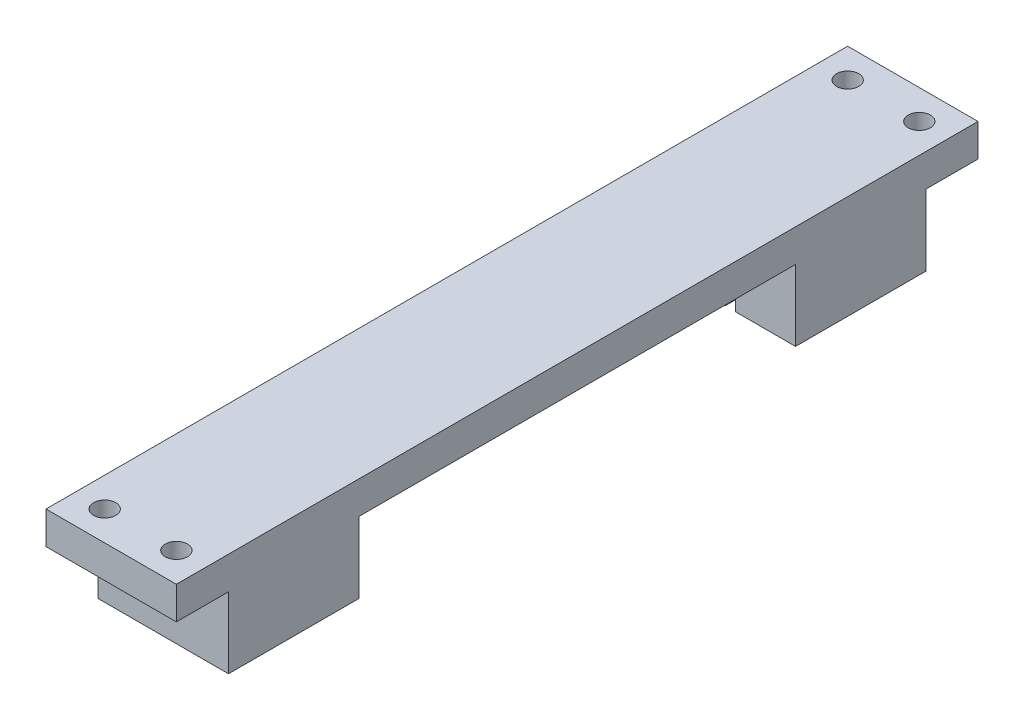
ISO-10303-21;
HEADER;
FILE_DESCRIPTION(('STEP AP214'),'2;1');
FILE_NAME('part.step','',(''),(''),'','','');
FILE_SCHEMA(('AUTOMOTIVE_DESIGN { 1 0 10303 214 1 1 1 1 }'));
ENDSEC;
DATA;
#1=APPLICATION_CONTEXT('core data for automotive mechanical design processes');
#2=APPLICATION_PROTOCOL_DEFINITION('international standard','automotive_design',2000,#1);
#3=PRODUCT_CONTEXT('',#1,'mechanical');
#4=PRODUCT('Part','Part','',(#3));
#5=PRODUCT_RELATED_PRODUCT_CATEGORY('part','',(#4));
#6=PRODUCT_DEFINITION_FORMATION('','',#4);
#7=PRODUCT_DEFINITION_CONTEXT('part definition',#1,'design');
#8=PRODUCT_DEFINITION('design','',#6,#7);
#9=PRODUCT_DEFINITION_SHAPE('','',#8);
#10=(LENGTH_UNIT() NAMED_UNIT(*) SI_UNIT(.MILLI.,.METRE.));
#11=(NAMED_UNIT(*) PLANE_ANGLE_UNIT() SI_UNIT($,.RADIAN.));
#12=(NAMED_UNIT(*) SI_UNIT($,.STERADIAN.) SOLID_ANGLE_UNIT());
#13=UNCERTAINTY_MEASURE_WITH_UNIT(LENGTH_MEASURE(1.E-05),#10,'distance_accuracy_value','');
#14=(GEOMETRIC_REPRESENTATION_CONTEXT(3) GLOBAL_UNCERTAINTY_ASSIGNED_CONTEXT((#13)) GLOBAL_UNIT_ASSIGNED_CONTEXT((#10,
#11,#12)) REPRESENTATION_CONTEXT('',''));
#15=CARTESIAN_POINT('',(0.,0.,0.));
#16=DIRECTION('',(0.,0.,1.));
#17=DIRECTION('',(1.,0.,0.));
#18=AXIS2_PLACEMENT_3D('',#15,#16,#17);
#19=CARTESIAN_POINT('',(10.,-10.9,-81.));
#20=DIRECTION('',(0.,0.,-1.));
#21=DIRECTION('',(-1.,0.,0.));
#22=AXIS2_PLACEMENT_3D('',#19,#20,#21);
#23=PLANE('',#22);
#24=DIRECTION('',(-1.,0.,0.));
#25=VECTOR('',#24,1.);
#26=CARTESIAN_POINT('',(10.,-10.9,-81.));
#27=LINE('',#26,#25);
#28=CARTESIAN_POINT('',(-0.799999999999998,-10.9,-81.));
#29=VERTEX_POINT('',#28);
#30=CARTESIAN_POINT('',(-10.,-10.9,-81.));
#31=VERTEX_POINT('',#30);
#32=EDGE_CURVE('E209',#29,#31,#27,.T.);
#33=ORIENTED_EDGE('',*,*,#32,.F.);
#34=DIRECTION('',(0.,1.,0.));
#35=VECTOR('',#34,1.);
#36=CARTESIAN_POINT('',(-0.799999999999999,-10.9,-81.));
#37=LINE('',#36,#35);
#38=CARTESIAN_POINT('',(-0.799999999999998,0.,-81.));
#39=VERTEX_POINT('',#38);
#40=EDGE_CURVE('E204',#29,#39,#37,.T.);
#41=ORIENTED_EDGE('',*,*,#40,.T.);
#42=DIRECTION('',(-1.,0.,0.));
#43=VECTOR('',#42,1.);
#44=CARTESIAN_POINT('',(10.,0.,-81.));
#45=LINE('',#44,#43);
#46=CARTESIAN_POINT('',(-10.,0.,-81.));
#47=VERTEX_POINT('',#46);
#48=EDGE_CURVE('E180',#39,#47,#45,.T.);
#49=ORIENTED_EDGE('',*,*,#48,.T.);
#50=DIRECTION('',(0.,1.,0.));
#51=VECTOR('',#50,1.);
#52=CARTESIAN_POINT('',(-10.,-10.9,-81.));
#53=LINE('',#52,#51);
#54=EDGE_CURVE('E226',#31,#47,#53,.T.);
#55=ORIENTED_EDGE('',*,*,#54,.F.);
#56=EDGE_LOOP('',(#33,#41,#49,#55));
#57=FACE_BOUND('',#56,.T.);
#58=ADVANCED_FACE('F35',(#57),#23,.F.);
#59=CARTESIAN_POINT('',(0.,0.,0.));
#60=DIRECTION('',(0.,-1.,0.));
#61=DIRECTION('',(0.,0.,-1.));
#62=AXIS2_PLACEMENT_3D('',#59,#60,#61);
#63=PLANE('',#62);
#64=ORIENTED_EDGE('',*,*,#48,.F.);
#65=DIRECTION('',(0.,0.,-1.));
#66=VECTOR('',#65,1.);
#67=CARTESIAN_POINT('',(-0.799999999999998,0.,-60.));
#68=LINE('',#67,#66);
#69=CARTESIAN_POINT('',(-0.799999999999998,0.,-88.5));
#70=VERTEX_POINT('',#69);
#71=EDGE_CURVE('E175',#39,#70,#68,.T.);
#72=ORIENTED_EDGE('',*,*,#71,.T.);
#73=DIRECTION('',(1.,0.,0.));
#74=VECTOR('',#73,1.);
#75=CARTESIAN_POINT('',(-0.799999999999998,0.,-88.5));
#76=LINE('',#75,#74);
#77=CARTESIAN_POINT('',(0.800000000000002,0.,-88.5));
#78=VERTEX_POINT('',#77);
#79=EDGE_CURVE('E178',#70,#78,#76,.T.);
#80=ORIENTED_EDGE('',*,*,#79,.T.);
#81=DIRECTION('',(0.,0.,1.));
#82=VECTOR('',#81,1.);
#83=CARTESIAN_POINT('',(0.800000000000002,0.,-60.));
#84=LINE('',#83,#82);
#85=CARTESIAN_POINT('',(0.800000000000002,0.,-81.));
#86=VERTEX_POINT('',#85);
#87=EDGE_CURVE('E188',#78,#86,#84,.T.);
#88=ORIENTED_EDGE('',*,*,#87,.T.);
#89=CARTESIAN_POINT('',(10.,0.,-81.));
#90=VERTEX_POINT('',#89);
#91=EDGE_CURVE('E219',#90,#86,#45,.T.);
#92=ORIENTED_EDGE('',*,*,#91,.F.);
#93=DIRECTION('',(0.,0.,1.));
#94=VECTOR('',#93,1.);
#95=CARTESIAN_POINT('',(10.,0.,-101.));
#96=LINE('',#95,#94);
#97=CARTESIAN_POINT('',(10.,0.,-14.));
#98=VERTEX_POINT('',#97);
#99=EDGE_CURVE('E259',#90,#98,#96,.T.);
#100=ORIENTED_EDGE('',*,*,#99,.T.);
#101=DIRECTION('',(-1.,0.,0.));
#102=VECTOR('',#101,1.);
#103=CARTESIAN_POINT('',(-10.,0.,-14.));
#104=LINE('',#103,#102);
#105=CARTESIAN_POINT('',(0.799999999999999,0.,-14.));
#106=VERTEX_POINT('',#105);
#107=EDGE_CURVE('E243',#98,#106,#104,.T.);
#108=ORIENTED_EDGE('',*,*,#107,.T.);
#109=DIRECTION('',(0.,0.,1.));
#110=VECTOR('',#109,1.);
#111=CARTESIAN_POINT('',(0.799999999999999,0.,-14.));
#112=LINE('',#111,#110);
#113=CARTESIAN_POINT('',(0.799999999999997,0.,1.));
#114=VERTEX_POINT('',#113);
#115=EDGE_CURVE('E289',#106,#114,#112,.T.);
#116=ORIENTED_EDGE('',*,*,#115,.T.);
#117=DIRECTION('',(-1.,0.,0.));
#118=VECTOR('',#117,1.);
#119=CARTESIAN_POINT('',(0.799999999999997,0.,1.));
#120=LINE('',#119,#118);
#121=CARTESIAN_POINT('',(-0.800000000000003,0.,1.));
#122=VERTEX_POINT('',#121);
#123=EDGE_CURVE('E292',#114,#122,#120,.T.);
#124=ORIENTED_EDGE('',*,*,#123,.T.);
#125=DIRECTION('',(0.,0.,-1.));
#126=VECTOR('',#125,1.);
#127=CARTESIAN_POINT('',(-0.800000000000001,0.,-14.));
#128=LINE('',#127,#126);
#129=CARTESIAN_POINT('',(-0.800000000000001,0.,-14.));
#130=VERTEX_POINT('',#129);
#131=EDGE_CURVE('E296',#122,#130,#128,.T.);
#132=ORIENTED_EDGE('',*,*,#131,.T.);
#133=CARTESIAN_POINT('',(-10.,0.,-14.));
#134=VERTEX_POINT('',#133);
#135=EDGE_CURVE('E43',#130,#134,#104,.T.);
#136=ORIENTED_EDGE('',*,*,#135,.T.);
#137=DIRECTION('',(0.,0.,1.));
#138=VECTOR('',#137,1.);
#139=CARTESIAN_POINT('',(-10.,0.,-101.));
#140=LINE('',#139,#138);
#141=EDGE_CURVE('E260',#47,#134,#140,.T.);
#142=ORIENTED_EDGE('',*,*,#141,.F.);
#143=EDGE_LOOP('',(#64,#72,#80,#88,#92,#100,#108,#116,#124,#132,#136,#142));
#144=FACE_BOUND('',#143,.T.);
#145=ADVANCED_FACE('F176',(#144),#63,.T.);
#146=CARTESIAN_POINT('',(5.5,0.,-104.5));
#147=DIRECTION('',(0.,-1.,0.));
#148=DIRECTION('',(0.,0.,-1.));
#149=AXIS2_PLACEMENT_3D('',#146,#147,#148);
#150=CIRCLE('',#149,1.69999999999999);
#151=CARTESIAN_POINT('',(5.5,0.,-106.2));
#152=VERTEX_POINT('',#151);
#153=EDGE_CURVE('E717',#152,#152,#150,.T.);
#154=ORIENTED_EDGE('',*,*,#153,.F.);
#155=EDGE_LOOP('',(#154));
#156=FACE_BOUND('',#155,.T.);
#157=CARTESIAN_POINT('',(-5.5,0.,-104.5));
#158=DIRECTION('',(0.,-1.,0.));
#159=DIRECTION('',(0.,0.,-1.));
#160=AXIS2_PLACEMENT_3D('',#157,#158,#159);
#161=CIRCLE('',#160,1.69999999999999);
#162=CARTESIAN_POINT('',(-5.5,0.,-106.2));
#163=VERTEX_POINT('',#162);
#164=EDGE_CURVE('E719',#163,#163,#161,.T.);
#165=ORIENTED_EDGE('',*,*,#164,.F.);
#166=EDGE_LOOP('',(#165));
#167=FACE_BOUND('',#166,.T.);
#168=CARTESIAN_POINT('',(10.,0.,-109.));
#169=VERTEX_POINT('',#168);
#170=CARTESIAN_POINT('',(10.,0.,-101.));
#171=VERTEX_POINT('',#170);
#172=EDGE_CURVE('E270',#169,#171,#96,.T.);
#173=ORIENTED_EDGE('',*,*,#172,.T.);
#174=DIRECTION('',(1.,0.,0.));
#175=VECTOR('',#174,1.);
#176=CARTESIAN_POINT('',(10.,0.,-101.));
#177=LINE('',#176,#175);
#178=CARTESIAN_POINT('',(-10.,0.,-101.));
#179=VERTEX_POINT('',#178);
#180=EDGE_CURVE('E210',#179,#171,#177,.T.);
#181=ORIENTED_EDGE('',*,*,#180,.F.);
#182=CARTESIAN_POINT('',(-10.,0.,-109.));
#183=VERTEX_POINT('',#182);
#184=EDGE_CURVE('E256',#183,#179,#140,.T.);
#185=ORIENTED_EDGE('',*,*,#184,.F.);
#186=DIRECTION('',(-1.,0.,0.));
#187=VECTOR('',#186,1.);
#188=CARTESIAN_POINT('',(10.,0.,-109.));
#189=LINE('',#188,#187);
#190=EDGE_CURVE('E234',#169,#183,#189,.T.);
#191=ORIENTED_EDGE('',*,*,#190,.F.);
#192=EDGE_LOOP('',(#173,#181,#185,#191));
#193=FACE_BOUND('',#192,.T.);
#194=ADVANCED_FACE('F431',(#156,#167,#193),#63,.T.);
#195=CARTESIAN_POINT('',(-10.,5.,-14.));
#196=DIRECTION('',(0.,0.,-1.));
#197=DIRECTION('',(-1.,0.,0.));
#198=AXIS2_PLACEMENT_3D('',#195,#196,#197);
#199=PLANE('',#198);
#200=ORIENTED_EDGE('',*,*,#107,.F.);
#201=DIRECTION('',(0.,-1.,0.));
#202=VECTOR('',#201,1.);
#203=CARTESIAN_POINT('',(10.,5.,-14.));
#204=LINE('',#203,#202);
#205=CARTESIAN_POINT('',(10.,-10.9,-14.));
#206=VERTEX_POINT('',#205);
#207=EDGE_CURVE('E253',#98,#206,#204,.T.);
#208=ORIENTED_EDGE('',*,*,#207,.T.);
#209=DIRECTION('',(1.,0.,0.));
#210=VECTOR('',#209,1.);
#211=CARTESIAN_POINT('',(10.,-10.9,-14.));
#212=LINE('',#211,#210);
#213=CARTESIAN_POINT('',(0.799999999999999,-10.9,-14.));
#214=VERTEX_POINT('',#213);
#215=EDGE_CURVE('E326',#214,#206,#212,.T.);
#216=ORIENTED_EDGE('',*,*,#215,.F.);
#217=DIRECTION('',(0.,-1.,0.));
#218=VECTOR('',#217,1.);
#219=CARTESIAN_POINT('',(0.799999999999999,0.,-14.));
#220=LINE('',#219,#218);
#221=EDGE_CURVE('E284',#106,#214,#220,.T.);
#222=ORIENTED_EDGE('',*,*,#221,.F.);
#223=EDGE_LOOP('',(#200,#208,#216,#222));
#224=FACE_BOUND('',#223,.T.);
#225=ADVANCED_FACE('F416',(#224),#199,.T.);
#226=CARTESIAN_POINT('',(0.,5.,0.));
#227=DIRECTION('',(0.,1.,0.));
#228=DIRECTION('',(0.,0.,1.));
#229=AXIS2_PLACEMENT_3D('',#226,#227,#228);
#230=PLANE('',#229);
#231=CARTESIAN_POINT('',(5.5,5.,-104.5));
#232=DIRECTION('',(0.,-1.,0.));
#233=DIRECTION('',(0.,0.,-1.));
#234=AXIS2_PLACEMENT_3D('',#231,#232,#233);
#235=CIRCLE('',#234,1.7);
#236=CARTESIAN_POINT('',(5.5,5.,-106.2));
#237=VERTEX_POINT('',#236);
#238=EDGE_CURVE('E715',#237,#237,#235,.T.);
#239=ORIENTED_EDGE('',*,*,#238,.T.);
#240=EDGE_LOOP('',(#239));
#241=FACE_BOUND('',#240,.T.);
#242=CARTESIAN_POINT('',(-5.5,5.,-104.5));
#243=DIRECTION('',(0.,-1.,0.));
#244=DIRECTION('',(0.,0.,-1.));
#245=AXIS2_PLACEMENT_3D('',#242,#243,#244);
#246=CIRCLE('',#245,1.7);
#247=CARTESIAN_POINT('',(-5.5,5.,-106.2));
#248=VERTEX_POINT('',#247);
#249=EDGE_CURVE('E198',#248,#248,#246,.T.);
#250=ORIENTED_EDGE('',*,*,#249,.T.);
#251=EDGE_LOOP('',(#250));
#252=FACE_BOUND('',#251,.T.);
#253=CARTESIAN_POINT('',(5.5,5.,9.50000000000001));
#254=DIRECTION('',(0.,1.,0.));
#255=DIRECTION('',(0.,0.,1.));
#256=AXIS2_PLACEMENT_3D('',#253,#254,#255);
#257=CIRCLE('',#256,1.69999999999999);
#258=CARTESIAN_POINT('',(5.5,5.,11.2));
#259=VERTEX_POINT('',#258);
#260=EDGE_CURVE('E280',#259,#259,#257,.F.);
#261=ORIENTED_EDGE('',*,*,#260,.T.);
#262=EDGE_LOOP('',(#261));
#263=FACE_BOUND('',#262,.T.);
#264=DIRECTION('',(1.,0.,0.));
#265=VECTOR('',#264,1.);
#266=CARTESIAN_POINT('',(-10.,5.,14.));
#267=LINE('',#266,#265);
#268=CARTESIAN_POINT('',(-10.,5.,14.));
#269=VERTEX_POINT('',#268);
#270=CARTESIAN_POINT('',(10.,5.,14.));
#271=VERTEX_POINT('',#270);
#272=EDGE_CURVE('E333',#269,#271,#267,.T.);
#273=ORIENTED_EDGE('',*,*,#272,.T.);
#274=DIRECTION('',(0.,0.,-1.));
#275=VECTOR('',#274,1.);
#276=CARTESIAN_POINT('',(10.,5.,14.));
#277=LINE('',#276,#275);
#278=CARTESIAN_POINT('',(10.,5.,-109.));
#279=VERTEX_POINT('',#278);
#280=EDGE_CURVE('E367',#271,#279,#277,.T.);
#281=ORIENTED_EDGE('',*,*,#280,.T.);
#282=DIRECTION('',(1.,0.,0.));
#283=VECTOR('',#282,1.);
#284=CARTESIAN_POINT('',(10.,5.,-109.));
#285=LINE('',#284,#283);
#286=CARTESIAN_POINT('',(-10.,5.,-109.));
#287=VERTEX_POINT('',#286);
#288=EDGE_CURVE('E240',#287,#279,#285,.T.);
#289=ORIENTED_EDGE('',*,*,#288,.F.);
#290=DIRECTION('',(0.,0.,-1.));
#291=VECTOR('',#290,1.);
#292=CARTESIAN_POINT('',(-10.,5.,14.));
#293=LINE('',#292,#291);
#294=EDGE_CURVE('E366',#269,#287,#293,.T.);
#295=ORIENTED_EDGE('',*,*,#294,.F.);
#296=EDGE_LOOP('',(#273,#281,#289,#295));
#297=FACE_BOUND('',#296,.T.);
#298=CARTESIAN_POINT('',(-5.5,5.,9.50000000000001));
#299=DIRECTION('',(0.,1.,0.));
#300=DIRECTION('',(0.,0.,1.));
#301=AXIS2_PLACEMENT_3D('',#298,#299,#300);
#302=CIRCLE('',#301,1.69999999999999);
#303=CARTESIAN_POINT('',(-5.5,5.,11.2));
#304=VERTEX_POINT('',#303);
#305=EDGE_CURVE('E309',#304,#304,#302,.F.);
#306=ORIENTED_EDGE('',*,*,#305,.T.);
#307=EDGE_LOOP('',(#306));
#308=FACE_BOUND('',#307,.T.);
#309=ADVANCED_FACE('F374',(#241,#252,#263,#297,#308),#230,.T.);
#310=CARTESIAN_POINT('',(0.,0.,0.));
#311=DIRECTION('',(0.,1.,0.));
#312=DIRECTION('',(0.,0.,1.));
#313=AXIS2_PLACEMENT_3D('',#310,#311,#312);
#314=PLANE('',#313);
#315=CARTESIAN_POINT('',(5.5,0.,9.50000000000001));
#316=DIRECTION('',(0.,-1.,0.));
#317=DIRECTION('',(0.,0.,-1.));
#318=AXIS2_PLACEMENT_3D('',#315,#316,#317);
#319=CIRCLE('',#318,1.69999999999999);
#320=CARTESIAN_POINT('',(5.5,0.,7.80000000000001));
#321=VERTEX_POINT('',#320);
#322=EDGE_CURVE('E276',#321,#321,#319,.T.);
#323=ORIENTED_EDGE('',*,*,#322,.F.);
#324=EDGE_LOOP('',(#323));
#325=FACE_BOUND('',#324,.T.);
#326=CARTESIAN_POINT('',(-5.5,0.,9.50000000000001));
#327=DIRECTION('',(0.,-1.,0.));
#328=DIRECTION('',(0.,0.,-1.));
#329=AXIS2_PLACEMENT_3D('',#326,#327,#328);
#330=CIRCLE('',#329,1.69999999999999);
#331=CARTESIAN_POINT('',(-5.5,0.,7.80000000000001));
#332=VERTEX_POINT('',#331);
#333=EDGE_CURVE('E475',#332,#332,#330,.T.);
#334=ORIENTED_EDGE('',*,*,#333,.F.);
#335=EDGE_LOOP('',(#334));
#336=FACE_BOUND('',#335,.T.);
#337=DIRECTION('',(-1.,0.,0.));
#338=VECTOR('',#337,1.);
#339=CARTESIAN_POINT('',(10.,0.,6.00000000000001));
#340=LINE('',#339,#338);
#341=CARTESIAN_POINT('',(10.,0.,6.00000000000001));
#342=VERTEX_POINT('',#341);
#343=CARTESIAN_POINT('',(-10.,0.,6.00000000000001));
#344=VERTEX_POINT('',#343);
#345=EDGE_CURVE('E286',#342,#344,#340,.T.);
#346=ORIENTED_EDGE('',*,*,#345,.F.);
#347=DIRECTION('',(0.,0.,-1.));
#348=VECTOR('',#347,1.);
#349=CARTESIAN_POINT('',(10.,0.,14.));
#350=LINE('',#349,#348);
#351=CARTESIAN_POINT('',(10.,0.,14.));
#352=VERTEX_POINT('',#351);
#353=EDGE_CURVE('E339',#352,#342,#350,.T.);
#354=ORIENTED_EDGE('',*,*,#353,.F.);
#355=DIRECTION('',(1.,0.,0.));
#356=VECTOR('',#355,1.);
#357=CARTESIAN_POINT('',(-10.,0.,14.));
#358=LINE('',#357,#356);
#359=CARTESIAN_POINT('',(-10.,0.,14.));
#360=VERTEX_POINT('',#359);
#361=EDGE_CURVE('E349',#360,#352,#358,.T.);
#362=ORIENTED_EDGE('',*,*,#361,.F.);
#363=DIRECTION('',(0.,0.,-1.));
#364=VECTOR('',#363,1.);
#365=CARTESIAN_POINT('',(-10.,0.,14.));
#366=LINE('',#365,#364);
#367=EDGE_CURVE('E360',#360,#344,#366,.T.);
#368=ORIENTED_EDGE('',*,*,#367,.T.);
#369=EDGE_LOOP('',(#346,#354,#362,#368));
#370=FACE_BOUND('',#369,.T.);
#371=ADVANCED_FACE('F390',(#325,#336,#370),#314,.F.);
#372=CARTESIAN_POINT('',(-10.,5.,14.));
#373=DIRECTION('',(0.,0.,-1.));
#374=DIRECTION('',(-1.,0.,0.));
#375=AXIS2_PLACEMENT_3D('',#372,#373,#374);
#376=PLANE('',#375);
#377=ORIENTED_EDGE('',*,*,#361,.T.);
#378=DIRECTION('',(0.,-1.,0.));
#379=VECTOR('',#378,1.);
#380=CARTESIAN_POINT('',(10.,5.,14.));
#381=LINE('',#380,#379);
#382=EDGE_CURVE('E252',#271,#352,#381,.T.);
#383=ORIENTED_EDGE('',*,*,#382,.F.);
#384=ORIENTED_EDGE('',*,*,#272,.F.);
#385=DIRECTION('',(0.,-1.,0.));
#386=VECTOR('',#385,1.);
#387=CARTESIAN_POINT('',(-10.,5.,14.));
#388=LINE('',#387,#386);
#389=EDGE_CURVE('E353',#269,#360,#388,.T.);
#390=ORIENTED_EDGE('',*,*,#389,.T.);
#391=EDGE_LOOP('',(#377,#383,#384,#390));
#392=FACE_BOUND('',#391,.T.);
#393=ADVANCED_FACE('F37',(#392),#376,.F.);
#394=CARTESIAN_POINT('',(10.,5.,14.));
#395=DIRECTION('',(-1.,0.,0.));
#396=DIRECTION('',(0.,0.,1.));
#397=AXIS2_PLACEMENT_3D('',#394,#395,#396);
#398=PLANE('',#397);
#399=ORIENTED_EDGE('',*,*,#353,.T.);
#400=DIRECTION('',(0.,1.,0.));
#401=VECTOR('',#400,1.);
#402=CARTESIAN_POINT('',(10.,-10.9,6.00000000000001));
#403=LINE('',#402,#401);
#404=CARTESIAN_POINT('',(10.,-10.9,6.00000000000001));
#405=VERTEX_POINT('',#404);
#406=EDGE_CURVE('E344',#405,#342,#403,.T.);
#407=ORIENTED_EDGE('',*,*,#406,.F.);
#408=DIRECTION('',(0.,0.,1.));
#409=VECTOR('',#408,1.);
#410=CARTESIAN_POINT('',(10.,-10.9,-14.));
#411=LINE('',#410,#409);
#412=EDGE_CURVE('E318',#206,#405,#411,.T.);
#413=ORIENTED_EDGE('',*,*,#412,.F.);
#414=ORIENTED_EDGE('',*,*,#207,.F.);
#415=ORIENTED_EDGE('',*,*,#99,.F.);
#416=DIRECTION('',(0.,1.,0.));
#417=VECTOR('',#416,1.);
#418=CARTESIAN_POINT('',(10.,-10.9,-81.));
#419=LINE('',#418,#417);
#420=CARTESIAN_POINT('',(10.,-10.9,-81.));
#421=VERTEX_POINT('',#420);
#422=EDGE_CURVE('E229',#421,#90,#419,.T.);
#423=ORIENTED_EDGE('',*,*,#422,.F.);
#424=DIRECTION('',(0.,0.,1.));
#425=VECTOR('',#424,1.);
#426=CARTESIAN_POINT('',(10.,-10.9,-81.));
#427=LINE('',#426,#425);
#428=CARTESIAN_POINT('',(10.,-10.9,-101.));
#429=VERTEX_POINT('',#428);
#430=EDGE_CURVE('E206',#429,#421,#427,.T.);
#431=ORIENTED_EDGE('',*,*,#430,.F.);
#432=DIRECTION('',(0.,1.,0.));
#433=VECTOR('',#432,1.);
#434=CARTESIAN_POINT('',(10.,-10.9,-101.));
#435=LINE('',#434,#433);
#436=EDGE_CURVE('E218',#429,#171,#435,.T.);
#437=ORIENTED_EDGE('',*,*,#436,.T.);
#438=ORIENTED_EDGE('',*,*,#172,.F.);
#439=DIRECTION('',(0.,-1.,0.));
#440=VECTOR('',#439,1.);
#441=CARTESIAN_POINT('',(10.,5.,-109.));
#442=LINE('',#441,#440);
#443=EDGE_CURVE('E231',#279,#169,#442,.T.);
#444=ORIENTED_EDGE('',*,*,#443,.F.);
#445=ORIENTED_EDGE('',*,*,#280,.F.);
#446=ORIENTED_EDGE('',*,*,#382,.T.);
#447=EDGE_LOOP('',(#399,#407,#413,#414,#415,#423,#431,#437,#438,#444,#445,#446));
#448=FACE_BOUND('',#447,.T.);
#449=ADVANCED_FACE('F380',(#448),#398,.F.);
#450=ORIENTED_EDGE('',*,*,#135,.F.);
#451=DIRECTION('',(0.,-1.,0.));
#452=VECTOR('',#451,1.);
#453=CARTESIAN_POINT('',(-0.800000000000001,0.,-14.));
#454=LINE('',#453,#452);
#455=CARTESIAN_POINT('',(-0.800000000000001,-10.9,-14.));
#456=VERTEX_POINT('',#455);
#457=EDGE_CURVE('E263',#130,#456,#454,.T.);
#458=ORIENTED_EDGE('',*,*,#457,.T.);
#459=CARTESIAN_POINT('',(-10.,-10.9,-14.));
#460=VERTEX_POINT('',#459);
#461=EDGE_CURVE('E327',#460,#456,#212,.T.);
#462=ORIENTED_EDGE('',*,*,#461,.F.);
#463=DIRECTION('',(0.,-1.,0.));
#464=VECTOR('',#463,1.);
#465=CARTESIAN_POINT('',(-10.,5.,-14.));
#466=LINE('',#465,#464);
#467=EDGE_CURVE('E351',#134,#460,#466,.T.);
#468=ORIENTED_EDGE('',*,*,#467,.F.);
#469=EDGE_LOOP('',(#450,#458,#462,#468));
#470=FACE_BOUND('',#469,.T.);
#471=ADVANCED_FACE('F403',(#470),#199,.T.);
#472=CARTESIAN_POINT('',(-10.,5.,14.));
#473=DIRECTION('',(-1.,0.,0.));
#474=DIRECTION('',(0.,0.,1.));
#475=AXIS2_PLACEMENT_3D('',#472,#473,#474);
#476=PLANE('',#475);
#477=ORIENTED_EDGE('',*,*,#367,.F.);
#478=ORIENTED_EDGE('',*,*,#389,.F.);
#479=ORIENTED_EDGE('',*,*,#294,.T.);
#480=DIRECTION('',(0.,1.,0.));
#481=VECTOR('',#480,1.);
#482=CARTESIAN_POINT('',(-10.,5.,-109.));
#483=LINE('',#482,#481);
#484=EDGE_CURVE('E237',#183,#287,#483,.T.);
#485=ORIENTED_EDGE('',*,*,#484,.F.);
#486=ORIENTED_EDGE('',*,*,#184,.T.);
#487=DIRECTION('',(0.,1.,0.));
#488=VECTOR('',#487,1.);
#489=CARTESIAN_POINT('',(-10.,-10.9,-101.));
#490=LINE('',#489,#488);
#491=CARTESIAN_POINT('',(-10.,-10.9,-101.));
#492=VERTEX_POINT('',#491);
#493=EDGE_CURVE('E58',#492,#179,#490,.T.);
#494=ORIENTED_EDGE('',*,*,#493,.F.);
#495=DIRECTION('',(0.,0.,-1.));
#496=VECTOR('',#495,1.);
#497=CARTESIAN_POINT('',(-10.,-10.9,-81.));
#498=LINE('',#497,#496);
#499=EDGE_CURVE('E214',#31,#492,#498,.T.);
#500=ORIENTED_EDGE('',*,*,#499,.F.);
#501=ORIENTED_EDGE('',*,*,#54,.T.);
#502=ORIENTED_EDGE('',*,*,#141,.T.);
#503=ORIENTED_EDGE('',*,*,#467,.T.);
#504=DIRECTION('',(0.,0.,-1.));
#505=VECTOR('',#504,1.);
#506=CARTESIAN_POINT('',(-10.,-10.9,-14.));
#507=LINE('',#506,#505);
#508=CARTESIAN_POINT('',(-10.,-10.9,6.00000000000001));
#509=VERTEX_POINT('',#508);
#510=EDGE_CURVE('E323',#509,#460,#507,.T.);
#511=ORIENTED_EDGE('',*,*,#510,.F.);
#512=DIRECTION('',(0.,1.,0.));
#513=VECTOR('',#512,1.);
#514=CARTESIAN_POINT('',(-10.,-10.9,6.00000000000001));
#515=LINE('',#514,#513);
#516=EDGE_CURVE('E330',#509,#344,#515,.T.);
#517=ORIENTED_EDGE('',*,*,#516,.T.);
#518=EDGE_LOOP('',(#477,#478,#479,#485,#486,#494,#500,#501,#502,#503,#511,#517));
#519=FACE_BOUND('',#518,.T.);
#520=ADVANCED_FACE('F388',(#519),#476,.T.);
#521=CARTESIAN_POINT('',(10.,-10.9,6.00000000000001));
#522=DIRECTION('',(0.,0.,-1.));
#523=DIRECTION('',(-1.,0.,0.));
#524=AXIS2_PLACEMENT_3D('',#521,#522,#523);
#525=PLANE('',#524);
#526=ORIENTED_EDGE('',*,*,#345,.T.);
#527=ORIENTED_EDGE('',*,*,#516,.F.);
#528=DIRECTION('',(-1.,0.,0.));
#529=VECTOR('',#528,1.);
#530=CARTESIAN_POINT('',(10.,-10.9,6.00000000000001));
#531=LINE('',#530,#529);
#532=EDGE_CURVE('E321',#405,#509,#531,.T.);
#533=ORIENTED_EDGE('',*,*,#532,.F.);
#534=ORIENTED_EDGE('',*,*,#406,.T.);
#535=EDGE_LOOP('',(#526,#527,#533,#534));
#536=FACE_BOUND('',#535,.T.);
#537=ADVANCED_FACE('F393',(#536),#525,.F.);
#538=CARTESIAN_POINT('',(0.,-10.9,0.));
#539=DIRECTION('',(0.,-1.,0.));
#540=DIRECTION('',(0.,0.,-1.));
#541=AXIS2_PLACEMENT_3D('',#538,#539,#540);
#542=PLANE('',#541);
#543=DIRECTION('',(0.,0.,1.));
#544=VECTOR('',#543,1.);
#545=CARTESIAN_POINT('',(0.799999999999999,-10.9,-14.));
#546=LINE('',#545,#544);
#547=CARTESIAN_POINT('',(0.799999999999997,-10.9,1.));
#548=VERTEX_POINT('',#547);
#549=EDGE_CURVE('E311',#214,#548,#546,.T.);
#550=ORIENTED_EDGE('',*,*,#549,.F.);
#551=ORIENTED_EDGE('',*,*,#215,.T.);
#552=ORIENTED_EDGE('',*,*,#412,.T.);
#553=ORIENTED_EDGE('',*,*,#532,.T.);
#554=ORIENTED_EDGE('',*,*,#510,.T.);
#555=ORIENTED_EDGE('',*,*,#461,.T.);
#556=DIRECTION('',(0.,0.,-1.));
#557=VECTOR('',#556,1.);
#558=CARTESIAN_POINT('',(-0.800000000000001,-10.9,-14.));
#559=LINE('',#558,#557);
#560=CARTESIAN_POINT('',(-0.800000000000003,-10.9,1.));
#561=VERTEX_POINT('',#560);
#562=EDGE_CURVE('E293',#561,#456,#559,.T.);
#563=ORIENTED_EDGE('',*,*,#562,.F.);
#564=DIRECTION('',(-1.,0.,0.));
#565=VECTOR('',#564,1.);
#566=CARTESIAN_POINT('',(0.799999999999997,-10.9,1.));
#567=LINE('',#566,#565);
#568=EDGE_CURVE('E313',#548,#561,#567,.T.);
#569=ORIENTED_EDGE('',*,*,#568,.F.);
#570=EDGE_LOOP('',(#550,#551,#552,#553,#554,#555,#563,#569));
#571=FACE_BOUND('',#570,.T.);
#572=ADVANCED_FACE('F399',(#571),#542,.T.);
#573=CARTESIAN_POINT('',(0.799999999999999,0.,-14.));
#574=DIRECTION('',(1.,0.,0.));
#575=DIRECTION('',(0.,0.,-1.));
#576=AXIS2_PLACEMENT_3D('',#573,#574,#575);
#577=PLANE('',#576);
#578=ORIENTED_EDGE('',*,*,#549,.T.);
#579=DIRECTION('',(0.,-1.,0.));
#580=VECTOR('',#579,1.);
#581=CARTESIAN_POINT('',(0.799999999999997,0.,1.));
#582=LINE('',#581,#580);
#583=EDGE_CURVE('E298',#114,#548,#582,.T.);
#584=ORIENTED_EDGE('',*,*,#583,.F.);
#585=ORIENTED_EDGE('',*,*,#115,.F.);
#586=ORIENTED_EDGE('',*,*,#221,.T.);
#587=EDGE_LOOP('',(#578,#584,#585,#586));
#588=FACE_BOUND('',#587,.T.);
#589=ADVANCED_FACE('F413',(#588),#577,.F.);
#590=CARTESIAN_POINT('',(-0.800000000000001,0.,-14.));
#591=DIRECTION('',(-1.,0.,0.));
#592=DIRECTION('',(0.,0.,1.));
#593=AXIS2_PLACEMENT_3D('',#590,#591,#592);
#594=PLANE('',#593);
#595=ORIENTED_EDGE('',*,*,#562,.T.);
#596=ORIENTED_EDGE('',*,*,#457,.F.);
#597=ORIENTED_EDGE('',*,*,#131,.F.);
#598=DIRECTION('',(0.,-1.,0.));
#599=VECTOR('',#598,1.);
#600=CARTESIAN_POINT('',(-0.800000000000003,0.,1.));
#601=LINE('',#600,#599);
#602=EDGE_CURVE('E303',#122,#561,#601,.T.);
#603=ORIENTED_EDGE('',*,*,#602,.T.);
#604=EDGE_LOOP('',(#595,#596,#597,#603));
#605=FACE_BOUND('',#604,.T.);
#606=ADVANCED_FACE('F406',(#605),#594,.F.);
#607=CARTESIAN_POINT('',(0.799999999999997,0.,1.));
#608=DIRECTION('',(0.,0.,1.));
#609=DIRECTION('',(1.,0.,0.));
#610=AXIS2_PLACEMENT_3D('',#607,#608,#609);
#611=PLANE('',#610);
#612=ORIENTED_EDGE('',*,*,#568,.T.);
#613=ORIENTED_EDGE('',*,*,#602,.F.);
#614=ORIENTED_EDGE('',*,*,#123,.F.);
#615=ORIENTED_EDGE('',*,*,#583,.T.);
#616=EDGE_LOOP('',(#612,#613,#614,#615));
#617=FACE_BOUND('',#616,.T.);
#618=ADVANCED_FACE('F411',(#617),#611,.F.);
#619=CARTESIAN_POINT('',(-5.5,0.,9.50000000000001));
#620=DIRECTION('',(0.,-1.,0.));
#621=DIRECTION('',(0.,0.,-1.));
#622=AXIS2_PLACEMENT_3D('',#619,#620,#621);
#623=CYLINDRICAL_SURFACE('',#622,1.69999999999999);
#624=ORIENTED_EDGE('',*,*,#305,.F.);
#625=EDGE_LOOP('',(#624));
#626=FACE_BOUND('',#625,.T.);
#627=ORIENTED_EDGE('',*,*,#333,.T.);
#628=EDGE_LOOP('',(#627));
#629=FACE_BOUND('',#628,.T.);
#630=ADVANCED_FACE('F461',(#626,#629),#623,.F.);
#631=CARTESIAN_POINT('',(5.5,0.,9.50000000000001));
#632=DIRECTION('',(0.,-1.,0.));
#633=DIRECTION('',(0.,0.,-1.));
#634=AXIS2_PLACEMENT_3D('',#631,#632,#633);
#635=CYLINDRICAL_SURFACE('',#634,1.69999999999999);
#636=ORIENTED_EDGE('',*,*,#260,.F.);
#637=EDGE_LOOP('',(#636));
#638=FACE_BOUND('',#637,.T.);
#639=ORIENTED_EDGE('',*,*,#322,.T.);
#640=EDGE_LOOP('',(#639));
#641=FACE_BOUND('',#640,.T.);
#642=ADVANCED_FACE('F457',(#638,#641),#635,.F.);
#643=CARTESIAN_POINT('',(0.,0.,-109.));
#644=DIRECTION('',(0.,0.,-1.));
#645=DIRECTION('',(-1.,0.,0.));
#646=AXIS2_PLACEMENT_3D('',#643,#644,#645);
#647=PLANE('',#646);
#648=ORIENTED_EDGE('',*,*,#443,.T.);
#649=ORIENTED_EDGE('',*,*,#190,.T.);
#650=ORIENTED_EDGE('',*,*,#484,.T.);
#651=ORIENTED_EDGE('',*,*,#288,.T.);
#652=EDGE_LOOP('',(#648,#649,#650,#651));
#653=FACE_BOUND('',#652,.T.);
#654=ADVANCED_FACE('F384',(#653),#647,.T.);
#655=ORIENTED_EDGE('',*,*,#91,.T.);
#656=DIRECTION('',(0.,-1.,0.));
#657=VECTOR('',#656,1.);
#658=CARTESIAN_POINT('',(0.800000000000002,-10.9,-81.));
#659=LINE('',#658,#657);
#660=CARTESIAN_POINT('',(0.800000000000002,-10.9,-81.));
#661=VERTEX_POINT('',#660);
#662=EDGE_CURVE('E200',#86,#661,#659,.T.);
#663=ORIENTED_EDGE('',*,*,#662,.T.);
#664=EDGE_CURVE('E211',#421,#661,#27,.T.);
#665=ORIENTED_EDGE('',*,*,#664,.F.);
#666=ORIENTED_EDGE('',*,*,#422,.T.);
#667=EDGE_LOOP('',(#655,#663,#665,#666));
#668=FACE_BOUND('',#667,.T.);
#669=ADVANCED_FACE('F422',(#668),#23,.F.);
#670=CARTESIAN_POINT('',(10.,-10.9,-101.));
#671=DIRECTION('',(0.,0.,1.));
#672=DIRECTION('',(1.,0.,0.));
#673=AXIS2_PLACEMENT_3D('',#670,#671,#672);
#674=PLANE('',#673);
#675=ORIENTED_EDGE('',*,*,#180,.T.);
#676=ORIENTED_EDGE('',*,*,#436,.F.);
#677=DIRECTION('',(1.,0.,0.));
#678=VECTOR('',#677,1.);
#679=CARTESIAN_POINT('',(10.,-10.9,-101.));
#680=LINE('',#679,#678);
#681=EDGE_CURVE('E216',#492,#429,#680,.T.);
#682=ORIENTED_EDGE('',*,*,#681,.F.);
#683=ORIENTED_EDGE('',*,*,#493,.T.);
#684=EDGE_LOOP('',(#675,#676,#682,#683));
#685=FACE_BOUND('',#684,.T.);
#686=ADVANCED_FACE('F430',(#685),#674,.F.);
#687=CARTESIAN_POINT('',(0.,-10.9,0.));
#688=DIRECTION('',(0.,1.,0.));
#689=DIRECTION('',(0.,0.,1.));
#690=AXIS2_PLACEMENT_3D('',#687,#688,#689);
#691=PLANE('',#690);
#692=DIRECTION('',(1.,0.,0.));
#693=VECTOR('',#692,1.);
#694=CARTESIAN_POINT('',(-0.799999999999998,-10.9,-88.5));
#695=LINE('',#694,#693);
#696=CARTESIAN_POINT('',(-0.799999999999998,-10.9,-88.5));
#697=VERTEX_POINT('',#696);
#698=CARTESIAN_POINT('',(0.800000000000002,-10.9,-88.5));
#699=VERTEX_POINT('',#698);
#700=EDGE_CURVE('E196',#697,#699,#695,.T.);
#701=ORIENTED_EDGE('',*,*,#700,.F.);
#702=DIRECTION('',(0.,0.,1.));
#703=VECTOR('',#702,1.);
#704=CARTESIAN_POINT('',(-0.799999999999999,-10.9,0.));
#705=LINE('',#704,#703);
#706=EDGE_CURVE('E11',#697,#29,#705,.T.);
#707=ORIENTED_EDGE('',*,*,#706,.T.);
#708=ORIENTED_EDGE('',*,*,#32,.T.);
#709=ORIENTED_EDGE('',*,*,#499,.T.);
#710=ORIENTED_EDGE('',*,*,#681,.T.);
#711=ORIENTED_EDGE('',*,*,#430,.T.);
#712=ORIENTED_EDGE('',*,*,#664,.T.);
#713=DIRECTION('',(0.,0.,1.));
#714=VECTOR('',#713,1.);
#715=CARTESIAN_POINT('',(0.800000000000002,-10.9,-60.));
#716=LINE('',#715,#714);
#717=EDGE_CURVE('E183',#699,#661,#716,.T.);
#718=ORIENTED_EDGE('',*,*,#717,.F.);
#719=EDGE_LOOP('',(#701,#707,#708,#709,#710,#711,#712,#718));
#720=FACE_BOUND('',#719,.T.);
#721=ADVANCED_FACE('F427',(#720),#691,.F.);
#722=CARTESIAN_POINT('',(-0.799999999999998,0.,-60.));
#723=DIRECTION('',(-1.,0.,0.));
#724=DIRECTION('',(0.,0.,1.));
#725=AXIS2_PLACEMENT_3D('',#722,#723,#724);
#726=PLANE('',#725);
#727=ORIENTED_EDGE('',*,*,#706,.F.);
#728=DIRECTION('',(0.,-1.,0.));
#729=VECTOR('',#728,1.);
#730=CARTESIAN_POINT('',(-0.799999999999998,0.,-88.5));
#731=LINE('',#730,#729);
#732=EDGE_CURVE('E50',#70,#697,#731,.T.);
#733=ORIENTED_EDGE('',*,*,#732,.F.);
#734=ORIENTED_EDGE('',*,*,#71,.F.);
#735=ORIENTED_EDGE('',*,*,#40,.F.);
#736=EDGE_LOOP('',(#727,#733,#734,#735));
#737=FACE_BOUND('',#736,.T.);
#738=ADVANCED_FACE('F185',(#737),#726,.F.);
#739=CARTESIAN_POINT('',(0.800000000000002,0.,-60.));
#740=DIRECTION('',(1.,0.,0.));
#741=DIRECTION('',(0.,0.,-1.));
#742=AXIS2_PLACEMENT_3D('',#739,#740,#741);
#743=PLANE('',#742);
#744=ORIENTED_EDGE('',*,*,#87,.F.);
#745=DIRECTION('',(0.,-1.,0.));
#746=VECTOR('',#745,1.);
#747=CARTESIAN_POINT('',(0.800000000000002,0.,-88.5));
#748=LINE('',#747,#746);
#749=EDGE_CURVE('E187',#78,#699,#748,.T.);
#750=ORIENTED_EDGE('',*,*,#749,.T.);
#751=ORIENTED_EDGE('',*,*,#717,.T.);
#752=ORIENTED_EDGE('',*,*,#662,.F.);
#753=EDGE_LOOP('',(#744,#750,#751,#752));
#754=FACE_BOUND('',#753,.T.);
#755=ADVANCED_FACE('F424',(#754),#743,.F.);
#756=CARTESIAN_POINT('',(-0.799999999999998,0.,-88.5));
#757=DIRECTION('',(0.,0.,-1.));
#758=DIRECTION('',(-1.,0.,0.));
#759=AXIS2_PLACEMENT_3D('',#756,#757,#758);
#760=PLANE('',#759);
#761=ORIENTED_EDGE('',*,*,#700,.T.);
#762=ORIENTED_EDGE('',*,*,#749,.F.);
#763=ORIENTED_EDGE('',*,*,#79,.F.);
#764=ORIENTED_EDGE('',*,*,#732,.T.);
#765=EDGE_LOOP('',(#761,#762,#763,#764));
#766=FACE_BOUND('',#765,.T.);
#767=ADVANCED_FACE('F190',(#766),#760,.F.);
#768=CARTESIAN_POINT('',(-5.5,0.,-104.5));
#769=DIRECTION('',(0.,-1.,0.));
#770=DIRECTION('',(0.,0.,-1.));
#771=AXIS2_PLACEMENT_3D('',#768,#769,#770);
#772=CYLINDRICAL_SURFACE('',#771,1.69999999999999);
#773=ORIENTED_EDGE('',*,*,#249,.F.);
#774=EDGE_LOOP('',(#773));
#775=FACE_BOUND('',#774,.T.);
#776=ORIENTED_EDGE('',*,*,#164,.T.);
#777=EDGE_LOOP('',(#776));
#778=FACE_BOUND('',#777,.T.);
#779=ADVANCED_FACE('F577',(#775,#778),#772,.F.);
#780=CARTESIAN_POINT('',(5.5,0.,-104.5));
#781=DIRECTION('',(0.,-1.,0.));
#782=DIRECTION('',(0.,0.,-1.));
#783=AXIS2_PLACEMENT_3D('',#780,#781,#782);
#784=CYLINDRICAL_SURFACE('',#783,1.69999999999999);
#785=ORIENTED_EDGE('',*,*,#238,.F.);
#786=EDGE_LOOP('',(#785));
#787=FACE_BOUND('',#786,.T.);
#788=ORIENTED_EDGE('',*,*,#153,.T.);
#789=EDGE_LOOP('',(#788));
#790=FACE_BOUND('',#789,.T.);
#791=ADVANCED_FACE('F582',(#787,#790),#784,.F.);
#792=CLOSED_SHELL('',(#58,#145,#194,#225,#309,#371,#393,#449,#471,#520,#537,#572,#589,#606,#618,
#630,#642,#654,#669,#686,#721,#738,#755,#767,#779,#791));
#793=MANIFOLD_SOLID_BREP('B2',#792);
#794=ADVANCED_BREP_SHAPE_REPRESENTATION('',(#18,#793),#14);
#795=SHAPE_DEFINITION_REPRESENTATION(#9,#794);
ENDSEC;
END-ISO-10303-21;
